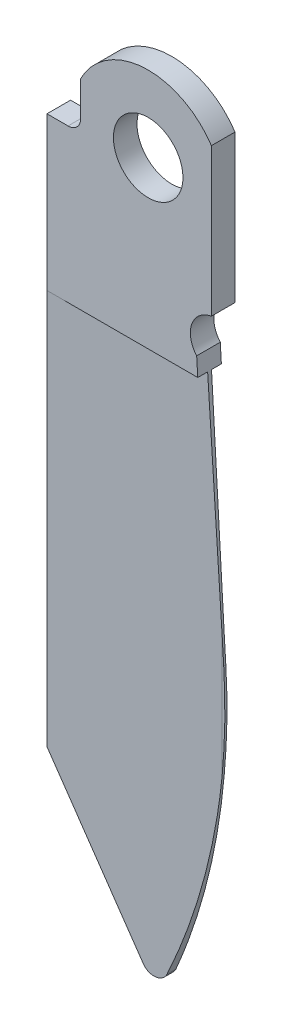
ISO-10303-21;
HEADER;
FILE_DESCRIPTION(('STEP AP214'),'2;1');
FILE_NAME('part.step','',(''),(''),'','','');
FILE_SCHEMA(('AUTOMOTIVE_DESIGN { 1 0 10303 214 1 1 1 1 }'));
ENDSEC;
DATA;
#1=APPLICATION_CONTEXT('core data for automotive mechanical design processes');
#2=APPLICATION_PROTOCOL_DEFINITION('international standard','automotive_design',2000,#1);
#3=PRODUCT_CONTEXT('',#1,'mechanical');
#4=PRODUCT('Part','Part','',(#3));
#5=PRODUCT_RELATED_PRODUCT_CATEGORY('part','',(#4));
#6=PRODUCT_DEFINITION_FORMATION('','',#4);
#7=PRODUCT_DEFINITION_CONTEXT('part definition',#1,'design');
#8=PRODUCT_DEFINITION('design','',#6,#7);
#9=PRODUCT_DEFINITION_SHAPE('','',#8);
#10=(LENGTH_UNIT() NAMED_UNIT(*) SI_UNIT(.MILLI.,.METRE.));
#11=(NAMED_UNIT(*) PLANE_ANGLE_UNIT() SI_UNIT($,.RADIAN.));
#12=(NAMED_UNIT(*) SI_UNIT($,.STERADIAN.) SOLID_ANGLE_UNIT());
#13=UNCERTAINTY_MEASURE_WITH_UNIT(LENGTH_MEASURE(1.E-05),#10,'distance_accuracy_value','');
#14=(GEOMETRIC_REPRESENTATION_CONTEXT(3) GLOBAL_UNCERTAINTY_ASSIGNED_CONTEXT((#13)) GLOBAL_UNIT_ASSIGNED_CONTEXT((#10,
#11,#12)) REPRESENTATION_CONTEXT('',''));
#15=CARTESIAN_POINT('',(0.,0.,0.));
#16=DIRECTION('',(0.,0.,1.));
#17=DIRECTION('',(1.,0.,0.));
#18=AXIS2_PLACEMENT_3D('',#15,#16,#17);
#19=CARTESIAN_POINT('',(54.8751910903859,25.8806728008312,0.7112));
#20=DIRECTION('',(0.849790592587873,0.527120430972992,0.));
#21=DIRECTION('',(-0.527120430972992,0.849790592587872,0.));
#22=AXIS2_PLACEMENT_3D('',#19,#20,#21);
#23=PLANE('',#22);
#24=DIRECTION('',(-0.526807632953416,0.849286319183169,-0.0344451144623387));
#25=VECTOR('',#24,1.);
#26=CARTESIAN_POINT('',(54.9010018885517,25.8390622462411,-0.709512370889155));
#27=LINE('',#26,#25);
#28=CARTESIAN_POINT('',(60.3236506588339,17.0970070324297,-0.354954566678399));
#29=VERTEX_POINT('',#28);
#30=CARTESIAN_POINT('',(54.8751910903858,25.8806728008312,-0.7112));
#31=VERTEX_POINT('',#30);
#32=EDGE_CURVE('E333',#29,#31,#27,.T.);
#33=ORIENTED_EDGE('',*,*,#32,.F.);
#34=DIRECTION('',(0.,0.,-1.));
#35=VECTOR('',#34,1.);
#36=CARTESIAN_POINT('',(60.3236506588339,17.0970070324297,0.7112));
#37=LINE('',#36,#35);
#38=CARTESIAN_POINT('',(60.3236506588339,17.0970070324297,0.354954566678399));
#39=VERTEX_POINT('',#38);
#40=EDGE_CURVE('E283',#39,#29,#37,.T.);
#41=ORIENTED_EDGE('',*,*,#40,.F.);
#42=DIRECTION('',(0.526807632953416,-0.849286319183169,-0.0344451144623387));
#43=VECTOR('',#42,1.);
#44=CARTESIAN_POINT('',(54.8751910903859,25.8806728008312,0.7112));
#45=LINE('',#44,#43);
#46=CARTESIAN_POINT('',(54.8751910903858,25.8806728008312,0.7112));
#47=VERTEX_POINT('',#46);
#48=EDGE_CURVE('E187',#47,#39,#45,.T.);
#49=ORIENTED_EDGE('',*,*,#48,.F.);
#50=DIRECTION('',(0.,0.,-1.));
#51=VECTOR('',#50,1.);
#52=CARTESIAN_POINT('',(54.8751910903859,25.8806728008312,0.7112));
#53=LINE('',#52,#51);
#54=EDGE_CURVE('E287',#47,#31,#53,.T.);
#55=ORIENTED_EDGE('',*,*,#54,.T.);
#56=EDGE_LOOP('',(#33,#41,#49,#55));
#57=FACE_BOUND('',#56,.T.);
#58=ADVANCED_FACE('F39',(#57),#23,.F.);
#59=CARTESIAN_POINT('',(60.9711910903859,17.4986728008312,0.7112));
#60=DIRECTION('',(0.,0.,-1.));
#61=DIRECTION('',(-1.,0.,0.));
#62=AXIS2_PLACEMENT_3D('',#59,#60,#61);
#63=CYLINDRICAL_SURFACE('',#62,0.762000000000022);
#64=CARTESIAN_POINT('',(60.9711910903859,17.4986728008312,-0.312615384615385));
#65=DIRECTION('',(0.0652452974777819,0.,-0.997869255542546));
#66=DIRECTION('',(-0.997869255542546,0.,-0.0652452974777819));
#67=AXIS2_PLACEMENT_3D('',#64,#65,#66);
#68=ELLIPSE('',#67,0.763627094198546,0.762000000000022);
#69=CARTESIAN_POINT('',(61.6662953678847,17.1864644674978,-0.267166258778919));
#70=VERTEX_POINT('',#69);
#71=EDGE_CURVE('E330',#70,#29,#68,.T.);
#72=ORIENTED_EDGE('',*,*,#71,.F.);
#73=DIRECTION('',(0.,0.,-1.));
#74=VECTOR('',#73,1.);
#75=CARTESIAN_POINT('',(61.6662953678847,17.1864644674978,0.7112));
#76=LINE('',#75,#74);
#77=CARTESIAN_POINT('',(61.6662953678847,17.1864644674978,0.267166258778919));
#78=VERTEX_POINT('',#77);
#79=EDGE_CURVE('E280',#78,#70,#76,.T.);
#80=ORIENTED_EDGE('',*,*,#79,.F.);
#81=CARTESIAN_POINT('',(60.9711910903859,17.4986728008312,0.312615384615385));
#82=DIRECTION('',(0.0652452974777819,0.,0.997869255542546));
#83=DIRECTION('',(0.997869255542546,0.,-0.0652452974777819));
#84=AXIS2_PLACEMENT_3D('',#81,#82,#83);
#85=ELLIPSE('',#84,0.763627094198546,0.762000000000022);
#86=EDGE_CURVE('E181',#39,#78,#85,.T.);
#87=ORIENTED_EDGE('',*,*,#86,.F.);
#88=ORIENTED_EDGE('',*,*,#40,.T.);
#89=EDGE_LOOP('',(#72,#80,#87,#88));
#90=FACE_BOUND('',#89,.T.);
#91=ADVANCED_FACE('F345',(#90),#63,.T.);
#92=CARTESIAN_POINT('',(27.6061857704402,32.4846728008312,0.7112));
#93=DIRECTION('',(0.,0.,-1.));
#94=DIRECTION('',(-1.,0.,0.));
#95=AXIS2_PLACEMENT_3D('',#92,#93,#94);
#96=CYLINDRICAL_SURFACE('',#95,37.338);
#97=DIRECTION('',(0.,0.,-1.));
#98=VECTOR('',#97,1.);
#99=CARTESIAN_POINT('',(64.8741404768633,34.7706728008312,0.7112));
#100=LINE('',#99,#98);
#101=CARTESIAN_POINT('',(64.8741404768633,34.7706728008312,0.0635));
#102=VERTEX_POINT('',#101);
#103=CARTESIAN_POINT('',(64.8741404768633,34.7706728008312,-0.0634999999999979));
#104=VERTEX_POINT('',#103);
#105=EDGE_CURVE('E175',#102,#104,#100,.T.);
#106=ORIENTED_EDGE('',*,*,#105,.F.);
#107=CARTESIAN_POINT('',(27.6061857704402,32.4846728008312,0.0635));
#108=DIRECTION('',(0.,0.,-1.));
#109=DIRECTION('',(-1.,0.,0.));
#110=AXIS2_PLACEMENT_3D('',#107,#108,#109);
#111=CIRCLE('',#110,37.338);
#112=CARTESIAN_POINT('',(64.7811910903859,28.9996730214892,0.0635));
#113=VERTEX_POINT('',#112);
#114=EDGE_CURVE('E157',#102,#113,#111,.T.);
#115=ORIENTED_EDGE('',*,*,#114,.T.);
#116=CARTESIAN_POINT('',(27.6061857704402,32.4846728008312,2.49417342476567));
#117=DIRECTION('',(0.0652452974777819,0.,0.997869255542546));
#118=DIRECTION('',(0.997869255542546,0.,-0.0652452974777819));
#119=AXIS2_PLACEMENT_3D('',#116,#117,#118);
#120=ELLIPSE('',#119,37.4177276157277,37.338);
#121=EDGE_CURVE('E171',#78,#113,#120,.T.);
#122=ORIENTED_EDGE('',*,*,#121,.F.);
#123=ORIENTED_EDGE('',*,*,#79,.T.);
#124=CARTESIAN_POINT('',(27.6061857704402,32.4846728008312,-2.49417342476567));
#125=DIRECTION('',(0.0652452974777819,0.,-0.997869255542546));
#126=DIRECTION('',(-0.997869255542546,0.,-0.0652452974777819));
#127=AXIS2_PLACEMENT_3D('',#124,#125,#126);
#128=ELLIPSE('',#127,37.4177276157277,37.338);
#129=CARTESIAN_POINT('',(64.7811910903859,28.9996730214892,-0.0635));
#130=VERTEX_POINT('',#129);
#131=EDGE_CURVE('E322',#130,#70,#128,.T.);
#132=ORIENTED_EDGE('',*,*,#131,.F.);
#133=CARTESIAN_POINT('',(27.6061857704402,32.4846728008312,-0.0634999999999979));
#134=DIRECTION('',(0.,0.,1.));
#135=DIRECTION('',(1.,0.,0.));
#136=AXIS2_PLACEMENT_3D('',#133,#134,#135);
#137=CIRCLE('',#136,37.338);
#138=EDGE_CURVE('E347',#130,#104,#137,.T.);
#139=ORIENTED_EDGE('',*,*,#138,.T.);
#140=EDGE_LOOP('',(#106,#115,#122,#123,#132,#139));
#141=FACE_BOUND('',#140,.T.);
#142=ADVANCED_FACE('F169',(#141),#96,.T.);
#143=CARTESIAN_POINT('',(64.8741404768633,34.7706728008312,0.7112));
#144=DIRECTION('',(-0.998124021276529,-0.061224489795918,0.));
#145=DIRECTION('',(0.061224489795918,-0.998124021276529,0.));
#146=AXIS2_PLACEMENT_3D('',#143,#144,#145);
#147=PLANE('',#146);
#148=DIRECTION('',(-0.0612239992366834,0.99811602384025,0.00400310764239853));
#149=VECTOR('',#148,1.);
#150=CARTESIAN_POINT('',(64.8739802449912,34.773285011745,0.0574330168142626));
#151=LINE('',#150,#149);
#152=CARTESIAN_POINT('',(64.7811910903859,36.2859980524623,0.0634999999999988));
#153=VERTEX_POINT('',#152);
#154=CARTESIAN_POINT('',(63.9594616691361,49.6824,0.117228462158635));
#155=VERTEX_POINT('',#154);
#156=EDGE_CURVE('E183',#153,#155,#151,.T.);
#157=ORIENTED_EDGE('',*,*,#156,.F.);
#158=DIRECTION('',(0.061224489795918,-0.998124021276529,0.));
#159=VECTOR('',#158,1.);
#160=CARTESIAN_POINT('',(64.8741404768633,34.7706728008312,0.0635));
#161=LINE('',#160,#159);
#162=EDGE_CURVE('E159',#153,#102,#161,.T.);
#163=ORIENTED_EDGE('',*,*,#162,.T.);
#164=ORIENTED_EDGE('',*,*,#105,.T.);
#165=DIRECTION('',(-0.061224489795918,0.998124021276529,0.));
#166=VECTOR('',#165,1.);
#167=CARTESIAN_POINT('',(64.8741404768633,34.7706728008312,-0.0634999999999979));
#168=LINE('',#167,#166);
#169=CARTESIAN_POINT('',(64.7811910903859,36.2859980524619,-0.0634999999999979));
#170=VERTEX_POINT('',#169);
#171=EDGE_CURVE('E177',#104,#170,#168,.T.);
#172=ORIENTED_EDGE('',*,*,#171,.T.);
#173=DIRECTION('',(0.0612239992366834,-0.99811602384025,0.00400310764239853));
#174=VECTOR('',#173,1.);
#175=CARTESIAN_POINT('',(64.8743288556864,34.767601718833,-0.0574102230380415));
#176=LINE('',#175,#174);
#177=CARTESIAN_POINT('',(63.9594616691361,49.6824,-0.117228462158635));
#178=VERTEX_POINT('',#177);
#179=EDGE_CURVE('E316',#178,#170,#176,.T.);
#180=ORIENTED_EDGE('',*,*,#179,.F.);
#181=DIRECTION('',(0.,0.,-1.));
#182=VECTOR('',#181,1.);
#183=CARTESIAN_POINT('',(63.9594616691361,49.6824,0.7112));
#184=LINE('',#183,#182);
#185=CARTESIAN_POINT('',(63.9594616691361,49.6824,-0.7112));
#186=VERTEX_POINT('',#185);
#187=EDGE_CURVE('E309',#178,#186,#184,.T.);
#188=ORIENTED_EDGE('',*,*,#187,.T.);
#189=DIRECTION('',(-0.061224489795918,0.998124021276529,0.));
#190=VECTOR('',#189,1.);
#191=CARTESIAN_POINT('',(64.8741404768633,34.7706728008312,-0.7112));
#192=LINE('',#191,#190);
#193=CARTESIAN_POINT('',(63.892088906043,50.780757429309,-0.7112));
#194=VERTEX_POINT('',#193);
#195=EDGE_CURVE('E238',#186,#194,#192,.T.);
#196=ORIENTED_EDGE('',*,*,#195,.T.);
#197=DIRECTION('',(0.,0.,-1.));
#198=VECTOR('',#197,1.);
#199=CARTESIAN_POINT('',(63.892088906043,50.780757429309,0.7112));
#200=LINE('',#199,#198);
#201=CARTESIAN_POINT('',(63.892088906043,50.780757429309,0.7112));
#202=VERTEX_POINT('',#201);
#203=EDGE_CURVE('E274',#202,#194,#200,.T.);
#204=ORIENTED_EDGE('',*,*,#203,.F.);
#205=DIRECTION('',(-0.061224489795918,0.998124021276529,0.));
#206=VECTOR('',#205,1.);
#207=CARTESIAN_POINT('',(64.8741404768633,34.7706728008312,0.7112));
#208=LINE('',#207,#206);
#209=CARTESIAN_POINT('',(63.9594616691361,49.6824,0.7112));
#210=VERTEX_POINT('',#209);
#211=EDGE_CURVE('E212',#210,#202,#208,.T.);
#212=ORIENTED_EDGE('',*,*,#211,.F.);
#213=DIRECTION('',(0.,0.,1.));
#214=VECTOR('',#213,1.);
#215=CARTESIAN_POINT('',(63.9594616691361,49.6824,0.7112));
#216=LINE('',#215,#214);
#217=EDGE_CURVE('E55',#155,#210,#216,.T.);
#218=ORIENTED_EDGE('',*,*,#217,.F.);
#219=EDGE_LOOP('',(#157,#163,#164,#172,#180,#188,#196,#204,#212,#218));
#220=FACE_BOUND('',#219,.T.);
#221=ADVANCED_FACE('F312',(#220),#147,.F.);
#222=CARTESIAN_POINT('',(56.1451910903858,59.6626728008312,0.7112));
#223=DIRECTION('',(0.,0.,1.));
#224=DIRECTION('',(1.,0.,0.));
#225=AXIS2_PLACEMENT_3D('',#222,#223,#224);
#226=PLANE('',#225);
#227=CARTESIAN_POINT('',(60.9711910903858,59.6626728008312,0.7112));
#228=DIRECTION('',(0.,0.,1.));
#229=DIRECTION('',(1.,0.,0.));
#230=AXIS2_PLACEMENT_3D('',#227,#228,#229);
#231=CIRCLE('',#230,2.0955);
#232=CARTESIAN_POINT('',(63.0666910903858,59.6626728008312,0.7112));
#233=VERTEX_POINT('',#232);
#234=EDGE_CURVE('E194',#233,#233,#231,.T.);
#235=ORIENTED_EDGE('',*,*,#234,.F.);
#236=EDGE_LOOP('',(#235));
#237=FACE_BOUND('',#236,.T.);
#238=DIRECTION('',(0.,-1.,0.));
#239=VECTOR('',#238,1.);
#240=CARTESIAN_POINT('',(54.8751910903858,58.9006728008311,0.7112));
#241=LINE('',#240,#239);
#242=CARTESIAN_POINT('',(54.8751910903858,58.9006728008311,0.7112));
#243=VERTEX_POINT('',#242);
#244=CARTESIAN_POINT('',(54.8751910903858,49.6824,0.7112));
#245=VERTEX_POINT('',#244);
#246=EDGE_CURVE('E207',#243,#245,#241,.T.);
#247=ORIENTED_EDGE('',*,*,#246,.T.);
#248=DIRECTION('',(1.,0.,0.));
#249=VECTOR('',#248,1.);
#250=CARTESIAN_POINT('',(54.8751910903858,49.6824,0.7112));
#251=LINE('',#250,#249);
#252=EDGE_CURVE('E356',#245,#210,#251,.T.);
#253=ORIENTED_EDGE('',*,*,#252,.T.);
#254=ORIENTED_EDGE('',*,*,#211,.T.);
#255=CARTESIAN_POINT('',(65.0351910903858,51.7886728008312,0.7112));
#256=DIRECTION('',(0.,0.,-1.));
#257=DIRECTION('',(1.,0.,0.));
#258=AXIS2_PLACEMENT_3D('',#255,#256,#257);
#259=CIRCLE('',#258,1.52399999999998);
#260=CARTESIAN_POINT('',(64.7811910903858,53.2913570657385,0.7112));
#261=VERTEX_POINT('',#260);
#262=EDGE_CURVE('E215',#202,#261,#259,.T.);
#263=ORIENTED_EDGE('',*,*,#262,.T.);
#264=DIRECTION('',(0.,1.,0.));
#265=VECTOR('',#264,1.);
#266=CARTESIAN_POINT('',(64.7811910903858,53.2913570657385,0.7112));
#267=LINE('',#266,#265);
#268=CARTESIAN_POINT('',(64.7811910903858,62.189940891082,0.7112));
#269=VERTEX_POINT('',#268);
#270=EDGE_CURVE('E218',#261,#269,#267,.T.);
#271=ORIENTED_EDGE('',*,*,#270,.T.);
#272=CARTESIAN_POINT('',(60.9711910903858,59.6626728008312,0.7112));
#273=DIRECTION('',(0.,0.,1.));
#274=DIRECTION('',(1.,0.,0.));
#275=AXIS2_PLACEMENT_3D('',#272,#273,#274);
#276=CIRCLE('',#275,4.572);
#277=CARTESIAN_POINT('',(56.9071910903859,61.7572104586449,0.7112));
#278=VERTEX_POINT('',#277);
#279=EDGE_CURVE('E221',#269,#278,#276,.T.);
#280=ORIENTED_EDGE('',*,*,#279,.T.);
#281=DIRECTION('',(0.,-1.,0.));
#282=VECTOR('',#281,1.);
#283=CARTESIAN_POINT('',(56.9071910903859,61.7572104586449,0.7112));
#284=LINE('',#283,#282);
#285=CARTESIAN_POINT('',(56.9071910903859,59.6626728008312,0.7112));
#286=VERTEX_POINT('',#285);
#287=EDGE_CURVE('E224',#278,#286,#284,.T.);
#288=ORIENTED_EDGE('',*,*,#287,.T.);
#289=CARTESIAN_POINT('',(56.1451910903858,59.6626728008312,0.7112));
#290=DIRECTION('',(0.,0.,-1.));
#291=DIRECTION('',(1.,0.,0.));
#292=AXIS2_PLACEMENT_3D('',#289,#290,#291);
#293=CIRCLE('',#292,0.762000000000047);
#294=CARTESIAN_POINT('',(56.1451910903858,58.9006728008311,0.7112));
#295=VERTEX_POINT('',#294);
#296=EDGE_CURVE('E227',#286,#295,#293,.T.);
#297=ORIENTED_EDGE('',*,*,#296,.T.);
#298=DIRECTION('',(-1.,0.,0.));
#299=VECTOR('',#298,1.);
#300=CARTESIAN_POINT('',(54.8751910903858,58.9006728008311,0.7112));
#301=LINE('',#300,#299);
#302=EDGE_CURVE('E203',#295,#243,#301,.T.);
#303=ORIENTED_EDGE('',*,*,#302,.T.);
#304=EDGE_LOOP('',(#247,#253,#254,#263,#271,#280,#288,#297,#303));
#305=FACE_BOUND('',#304,.T.);
#306=ADVANCED_FACE('F370',(#237,#305),#226,.T.);
#307=CARTESIAN_POINT('',(54.8751910903858,58.9006728008311,0.7112));
#308=DIRECTION('',(0.,-1.,0.));
#309=DIRECTION('',(0.,0.,-1.));
#310=AXIS2_PLACEMENT_3D('',#307,#308,#309);
#311=PLANE('',#310);
#312=DIRECTION('',(-1.,0.,0.));
#313=VECTOR('',#312,1.);
#314=CARTESIAN_POINT('',(54.8751910903858,58.9006728008311,-0.7112));
#315=LINE('',#314,#313);
#316=CARTESIAN_POINT('',(56.1451910903858,58.9006728008311,-0.7112));
#317=VERTEX_POINT('',#316);
#318=CARTESIAN_POINT('',(54.8751910903858,58.9006728008311,-0.7112));
#319=VERTEX_POINT('',#318);
#320=EDGE_CURVE('E199',#317,#319,#315,.T.);
#321=ORIENTED_EDGE('',*,*,#320,.T.);
#322=DIRECTION('',(0.,0.,-1.));
#323=VECTOR('',#322,1.);
#324=CARTESIAN_POINT('',(54.8751910903858,58.9006728008311,0.7112));
#325=LINE('',#324,#323);
#326=EDGE_CURVE('E48',#243,#319,#325,.T.);
#327=ORIENTED_EDGE('',*,*,#326,.F.);
#328=ORIENTED_EDGE('',*,*,#302,.F.);
#329=DIRECTION('',(0.,0.,-1.));
#330=VECTOR('',#329,1.);
#331=CARTESIAN_POINT('',(56.1451910903858,58.9006728008311,0.7112));
#332=LINE('',#331,#330);
#333=EDGE_CURVE('E230',#295,#317,#332,.T.);
#334=ORIENTED_EDGE('',*,*,#333,.T.);
#335=EDGE_LOOP('',(#321,#327,#328,#334));
#336=FACE_BOUND('',#335,.T.);
#337=ADVANCED_FACE('F41',(#336),#311,.F.);
#338=CARTESIAN_POINT('',(54.8751910903858,58.9006728008311,0.7112));
#339=DIRECTION('',(1.,0.,0.));
#340=DIRECTION('',(0.,1.,0.));
#341=AXIS2_PLACEMENT_3D('',#338,#339,#340);
#342=PLANE('',#341);
#343=DIRECTION('',(0.,-1.,0.));
#344=VECTOR('',#343,1.);
#345=CARTESIAN_POINT('',(54.8751910903858,58.9006728008311,-0.7112));
#346=LINE('',#345,#344);
#347=CARTESIAN_POINT('',(54.8751910903858,49.6824,-0.7112));
#348=VERTEX_POINT('',#347);
#349=EDGE_CURVE('E234',#319,#348,#346,.T.);
#350=ORIENTED_EDGE('',*,*,#349,.T.);
#351=DIRECTION('',(0.,-1.,0.));
#352=VECTOR('',#351,1.);
#353=CARTESIAN_POINT('',(54.8751910903858,49.6824,-0.7112));
#354=LINE('',#353,#352);
#355=EDGE_CURVE('E318',#348,#31,#354,.T.);
#356=ORIENTED_EDGE('',*,*,#355,.T.);
#357=ORIENTED_EDGE('',*,*,#54,.F.);
#358=DIRECTION('',(0.,-1.,0.));
#359=VECTOR('',#358,1.);
#360=CARTESIAN_POINT('',(54.8751910903858,49.6824,0.7112));
#361=LINE('',#360,#359);
#362=EDGE_CURVE('E164',#245,#47,#361,.T.);
#363=ORIENTED_EDGE('',*,*,#362,.F.);
#364=ORIENTED_EDGE('',*,*,#246,.F.);
#365=ORIENTED_EDGE('',*,*,#326,.T.);
#366=EDGE_LOOP('',(#350,#356,#357,#363,#364,#365));
#367=FACE_BOUND('',#366,.T.);
#368=ADVANCED_FACE('F294',(#367),#342,.F.);
#369=CARTESIAN_POINT('',(65.0351910903858,51.7886728008312,0.7112));
#370=DIRECTION('',(0.,0.,-1.));
#371=DIRECTION('',(-1.,0.,0.));
#372=AXIS2_PLACEMENT_3D('',#369,#370,#371);
#373=CYLINDRICAL_SURFACE('',#372,1.52399999999998);
#374=CARTESIAN_POINT('',(65.0351910903858,51.7886728008312,-0.7112));
#375=DIRECTION('',(0.,0.,-1.));
#376=DIRECTION('',(1.,0.,0.));
#377=AXIS2_PLACEMENT_3D('',#374,#375,#376);
#378=CIRCLE('',#377,1.52399999999998);
#379=CARTESIAN_POINT('',(64.7811910903858,53.2913570657385,-0.7112));
#380=VERTEX_POINT('',#379);
#381=EDGE_CURVE('E241',#194,#380,#378,.T.);
#382=ORIENTED_EDGE('',*,*,#381,.T.);
#383=DIRECTION('',(0.,0.,-1.));
#384=VECTOR('',#383,1.);
#385=CARTESIAN_POINT('',(64.7811910903858,53.2913570657385,0.7112));
#386=LINE('',#385,#384);
#387=EDGE_CURVE('E270',#261,#380,#386,.T.);
#388=ORIENTED_EDGE('',*,*,#387,.F.);
#389=ORIENTED_EDGE('',*,*,#262,.F.);
#390=ORIENTED_EDGE('',*,*,#203,.T.);
#391=EDGE_LOOP('',(#382,#388,#389,#390));
#392=FACE_BOUND('',#391,.T.);
#393=ADVANCED_FACE('F391',(#392),#373,.F.);
#394=CARTESIAN_POINT('',(64.7811910903858,53.2913570657385,0.7112));
#395=DIRECTION('',(-1.,0.,0.));
#396=DIRECTION('',(0.,-1.,0.));
#397=AXIS2_PLACEMENT_3D('',#394,#395,#396);
#398=PLANE('',#397);
#399=DIRECTION('',(0.,1.,0.));
#400=VECTOR('',#399,1.);
#401=CARTESIAN_POINT('',(64.7811910903858,53.2913570657385,-0.7112));
#402=LINE('',#401,#400);
#403=CARTESIAN_POINT('',(64.7811910903858,62.189940891082,-0.7112));
#404=VERTEX_POINT('',#403);
#405=EDGE_CURVE('E244',#380,#404,#402,.T.);
#406=ORIENTED_EDGE('',*,*,#405,.T.);
#407=DIRECTION('',(0.,0.,-1.));
#408=VECTOR('',#407,1.);
#409=CARTESIAN_POINT('',(64.7811910903858,62.189940891082,0.7112));
#410=LINE('',#409,#408);
#411=EDGE_CURVE('E266',#269,#404,#410,.T.);
#412=ORIENTED_EDGE('',*,*,#411,.F.);
#413=ORIENTED_EDGE('',*,*,#270,.F.);
#414=ORIENTED_EDGE('',*,*,#387,.T.);
#415=EDGE_LOOP('',(#406,#412,#413,#414));
#416=FACE_BOUND('',#415,.T.);
#417=ADVANCED_FACE('F387',(#416),#398,.F.);
#418=CARTESIAN_POINT('',(60.9711910903858,59.6626728008312,0.7112));
#419=DIRECTION('',(0.,0.,-1.));
#420=DIRECTION('',(-1.,0.,0.));
#421=AXIS2_PLACEMENT_3D('',#418,#419,#420);
#422=CYLINDRICAL_SURFACE('',#421,4.572);
#423=CARTESIAN_POINT('',(60.9711910903858,59.6626728008312,-0.7112));
#424=DIRECTION('',(0.,0.,1.));
#425=DIRECTION('',(1.,0.,0.));
#426=AXIS2_PLACEMENT_3D('',#423,#424,#425);
#427=CIRCLE('',#426,4.572);
#428=CARTESIAN_POINT('',(56.9071910903859,61.7572104586449,-0.7112));
#429=VERTEX_POINT('',#428);
#430=EDGE_CURVE('E247',#404,#429,#427,.T.);
#431=ORIENTED_EDGE('',*,*,#430,.T.);
#432=DIRECTION('',(0.,0.,-1.));
#433=VECTOR('',#432,1.);
#434=CARTESIAN_POINT('',(56.9071910903859,61.7572104586449,0.7112));
#435=LINE('',#434,#433);
#436=EDGE_CURVE('E262',#278,#429,#435,.T.);
#437=ORIENTED_EDGE('',*,*,#436,.F.);
#438=ORIENTED_EDGE('',*,*,#279,.F.);
#439=ORIENTED_EDGE('',*,*,#411,.T.);
#440=EDGE_LOOP('',(#431,#437,#438,#439));
#441=FACE_BOUND('',#440,.T.);
#442=ADVANCED_FACE('F382',(#441),#422,.T.);
#443=CARTESIAN_POINT('',(56.9071910903859,61.7572104586449,0.7112));
#444=DIRECTION('',(1.,0.,0.));
#445=DIRECTION('',(0.,0.,-1.));
#446=AXIS2_PLACEMENT_3D('',#443,#444,#445);
#447=PLANE('',#446);
#448=DIRECTION('',(0.,-1.,0.));
#449=VECTOR('',#448,1.);
#450=CARTESIAN_POINT('',(56.9071910903859,61.7572104586449,-0.7112));
#451=LINE('',#450,#449);
#452=CARTESIAN_POINT('',(56.9071910903859,59.6626728008312,-0.7112));
#453=VERTEX_POINT('',#452);
#454=EDGE_CURVE('E250',#429,#453,#451,.T.);
#455=ORIENTED_EDGE('',*,*,#454,.T.);
#456=DIRECTION('',(0.,0.,-1.));
#457=VECTOR('',#456,1.);
#458=CARTESIAN_POINT('',(56.9071910903859,59.6626728008312,0.7112));
#459=LINE('',#458,#457);
#460=EDGE_CURVE('E258',#286,#453,#459,.T.);
#461=ORIENTED_EDGE('',*,*,#460,.F.);
#462=ORIENTED_EDGE('',*,*,#287,.F.);
#463=ORIENTED_EDGE('',*,*,#436,.T.);
#464=EDGE_LOOP('',(#455,#461,#462,#463));
#465=FACE_BOUND('',#464,.T.);
#466=ADVANCED_FACE('F377',(#465),#447,.F.);
#467=CARTESIAN_POINT('',(56.1451910903858,59.6626728008312,0.7112));
#468=DIRECTION('',(0.,0.,-1.));
#469=DIRECTION('',(-1.,0.,0.));
#470=AXIS2_PLACEMENT_3D('',#467,#468,#469);
#471=CYLINDRICAL_SURFACE('',#470,0.762000000000047);
#472=CARTESIAN_POINT('',(56.1451910903858,59.6626728008312,-0.7112));
#473=DIRECTION('',(0.,0.,-1.));
#474=DIRECTION('',(1.,0.,0.));
#475=AXIS2_PLACEMENT_3D('',#472,#473,#474);
#476=CIRCLE('',#475,0.762000000000047);
#477=EDGE_CURVE('E208',#453,#317,#476,.T.);
#478=ORIENTED_EDGE('',*,*,#477,.T.);
#479=ORIENTED_EDGE('',*,*,#333,.F.);
#480=ORIENTED_EDGE('',*,*,#296,.F.);
#481=ORIENTED_EDGE('',*,*,#460,.T.);
#482=EDGE_LOOP('',(#478,#479,#480,#481));
#483=FACE_BOUND('',#482,.T.);
#484=ADVANCED_FACE('F375',(#483),#471,.F.);
#485=CARTESIAN_POINT('',(56.1451910903858,59.6626728008312,-0.7112));
#486=DIRECTION('',(0.,0.,1.));
#487=DIRECTION('',(1.,0.,0.));
#488=AXIS2_PLACEMENT_3D('',#485,#486,#487);
#489=PLANE('',#488);
#490=CARTESIAN_POINT('',(60.9711910903858,59.6626728008312,-0.7112));
#491=DIRECTION('',(0.,0.,1.));
#492=DIRECTION('',(1.,0.,0.));
#493=AXIS2_PLACEMENT_3D('',#490,#491,#492);
#494=CIRCLE('',#493,2.0955);
#495=CARTESIAN_POINT('',(63.0666910903858,59.6626728008312,-0.7112));
#496=VERTEX_POINT('',#495);
#497=EDGE_CURVE('E195',#496,#496,#494,.T.);
#498=ORIENTED_EDGE('',*,*,#497,.T.);
#499=EDGE_LOOP('',(#498));
#500=FACE_BOUND('',#499,.T.);
#501=ORIENTED_EDGE('',*,*,#195,.F.);
#502=DIRECTION('',(-1.,0.,0.));
#503=VECTOR('',#502,1.);
#504=CARTESIAN_POINT('',(56.1451910903858,49.6824,-0.7112));
#505=LINE('',#504,#503);
#506=EDGE_CURVE('E11',#186,#348,#505,.T.);
#507=ORIENTED_EDGE('',*,*,#506,.T.);
#508=ORIENTED_EDGE('',*,*,#349,.F.);
#509=ORIENTED_EDGE('',*,*,#320,.F.);
#510=ORIENTED_EDGE('',*,*,#477,.F.);
#511=ORIENTED_EDGE('',*,*,#454,.F.);
#512=ORIENTED_EDGE('',*,*,#430,.F.);
#513=ORIENTED_EDGE('',*,*,#405,.F.);
#514=ORIENTED_EDGE('',*,*,#381,.F.);
#515=EDGE_LOOP('',(#501,#507,#508,#509,#510,#511,#512,#513,#514));
#516=FACE_BOUND('',#515,.T.);
#517=ADVANCED_FACE('F304',(#500,#516),#489,.F.);
#518=CARTESIAN_POINT('',(60.9711910903858,59.6626728008312,-0.7112));
#519=DIRECTION('',(0.,0.,1.));
#520=DIRECTION('',(1.,0.,0.));
#521=AXIS2_PLACEMENT_3D('',#518,#519,#520);
#522=CYLINDRICAL_SURFACE('',#521,2.0955);
#523=ORIENTED_EDGE('',*,*,#497,.F.);
#524=EDGE_LOOP('',(#523));
#525=FACE_BOUND('',#524,.T.);
#526=ORIENTED_EDGE('',*,*,#234,.T.);
#527=EDGE_LOOP('',(#526));
#528=FACE_BOUND('',#527,.T.);
#529=ADVANCED_FACE('F420',(#525,#528),#522,.F.);
#530=CARTESIAN_POINT('',(64.7811910903859,49.6824,-0.0635));
#531=DIRECTION('',(0.0652452974777819,0.,-0.997869255542546));
#532=DIRECTION('',(-0.997869255542546,0.,-0.0652452974777819));
#533=AXIS2_PLACEMENT_3D('',#530,#531,#532);
#534=PLANE('',#533);
#535=ORIENTED_EDGE('',*,*,#32,.T.);
#536=ORIENTED_EDGE('',*,*,#355,.F.);
#537=DIRECTION('',(0.997869255542547,0.,0.0652452974777819));
#538=VECTOR('',#537,1.);
#539=CARTESIAN_POINT('',(64.7811910903859,49.6824,-0.0635));
#540=LINE('',#539,#538);
#541=EDGE_CURVE('E63',#348,#178,#540,.T.);
#542=ORIENTED_EDGE('',*,*,#541,.T.);
#543=ORIENTED_EDGE('',*,*,#179,.T.);
#544=DIRECTION('',(0.,-1.,0.));
#545=VECTOR('',#544,1.);
#546=CARTESIAN_POINT('',(64.7811910903859,49.6824,-0.0635));
#547=LINE('',#546,#545);
#548=EDGE_CURVE('E324',#170,#130,#547,.T.);
#549=ORIENTED_EDGE('',*,*,#548,.T.);
#550=ORIENTED_EDGE('',*,*,#131,.T.);
#551=ORIENTED_EDGE('',*,*,#71,.T.);
#552=EDGE_LOOP('',(#535,#536,#542,#543,#549,#550,#551));
#553=FACE_BOUND('',#552,.T.);
#554=ADVANCED_FACE('F338',(#553),#534,.T.);
#555=CARTESIAN_POINT('',(0.,49.6824,0.));
#556=DIRECTION('',(0.,1.,0.));
#557=DIRECTION('',(0.,0.,1.));
#558=AXIS2_PLACEMENT_3D('',#555,#556,#557);
#559=PLANE('',#558);
#560=ORIENTED_EDGE('',*,*,#541,.F.);
#561=ORIENTED_EDGE('',*,*,#506,.F.);
#562=ORIENTED_EDGE('',*,*,#187,.F.);
#563=EDGE_LOOP('',(#560,#561,#562));
#564=FACE_BOUND('',#563,.T.);
#565=ADVANCED_FACE('F308',(#564),#559,.F.);
#566=CARTESIAN_POINT('',(54.8751910903858,49.6824,0.7112));
#567=DIRECTION('',(0.0652452974777819,0.,0.997869255542546));
#568=DIRECTION('',(0.997869255542546,0.,-0.0652452974777819));
#569=AXIS2_PLACEMENT_3D('',#566,#567,#568);
#570=PLANE('',#569);
#571=ORIENTED_EDGE('',*,*,#48,.T.);
#572=ORIENTED_EDGE('',*,*,#86,.T.);
#573=ORIENTED_EDGE('',*,*,#121,.T.);
#574=DIRECTION('',(0.,-1.,0.));
#575=VECTOR('',#574,1.);
#576=CARTESIAN_POINT('',(64.7811910903859,49.6824,0.0635));
#577=LINE('',#576,#575);
#578=EDGE_CURVE('E154',#153,#113,#577,.T.);
#579=ORIENTED_EDGE('',*,*,#578,.F.);
#580=ORIENTED_EDGE('',*,*,#156,.T.);
#581=DIRECTION('',(-0.997869255542547,0.,0.0652452974777819));
#582=VECTOR('',#581,1.);
#583=CARTESIAN_POINT('',(54.8751910903858,49.6824,0.7112));
#584=LINE('',#583,#582);
#585=EDGE_CURVE('E359',#155,#245,#584,.T.);
#586=ORIENTED_EDGE('',*,*,#585,.T.);
#587=ORIENTED_EDGE('',*,*,#362,.T.);
#588=EDGE_LOOP('',(#571,#572,#573,#579,#580,#586,#587));
#589=FACE_BOUND('',#588,.T.);
#590=ADVANCED_FACE('F179',(#589),#570,.T.);
#591=CARTESIAN_POINT('',(0.,49.6824,0.));
#592=DIRECTION('',(0.,-1.,0.));
#593=DIRECTION('',(0.,0.,-1.));
#594=AXIS2_PLACEMENT_3D('',#591,#592,#593);
#595=PLANE('',#594);
#596=ORIENTED_EDGE('',*,*,#217,.T.);
#597=ORIENTED_EDGE('',*,*,#252,.F.);
#598=ORIENTED_EDGE('',*,*,#585,.F.);
#599=EDGE_LOOP('',(#596,#597,#598));
#600=FACE_BOUND('',#599,.T.);
#601=ADVANCED_FACE('F368',(#600),#595,.T.);
#602=CARTESIAN_POINT('',(90.1811910903859,36.2859980524631,0.0635));
#603=DIRECTION('',(0.,0.,-1.));
#604=DIRECTION('',(-1.,0.,0.));
#605=AXIS2_PLACEMENT_3D('',#602,#603,#604);
#606=PLANE('',#605);
#607=ORIENTED_EDGE('',*,*,#162,.F.);
#608=ORIENTED_EDGE('',*,*,#578,.T.);
#609=ORIENTED_EDGE('',*,*,#114,.F.);
#610=EDGE_LOOP('',(#607,#608,#609));
#611=FACE_BOUND('',#610,.T.);
#612=ADVANCED_FACE('F156',(#611),#606,.F.);
#613=CARTESIAN_POINT('',(90.1811910903859,36.2859980524619,-0.0634999999999979));
#614=DIRECTION('',(0.,0.,1.));
#615=DIRECTION('',(1.,0.,0.));
#616=AXIS2_PLACEMENT_3D('',#613,#614,#615);
#617=PLANE('',#616);
#618=ORIENTED_EDGE('',*,*,#548,.F.);
#619=ORIENTED_EDGE('',*,*,#171,.F.);
#620=ORIENTED_EDGE('',*,*,#138,.F.);
#621=EDGE_LOOP('',(#618,#619,#620));
#622=FACE_BOUND('',#621,.T.);
#623=ADVANCED_FACE('F483',(#622),#617,.F.);
#624=CLOSED_SHELL('',(#58,#91,#142,#221,#306,#337,#368,#393,#417,#442,#466,#484,#517,#529,#554,
#565,#590,#601,#612,#623));
#625=MANIFOLD_SOLID_BREP('B2',#624);
#626=ADVANCED_BREP_SHAPE_REPRESENTATION('',(#18,#625),#14);
#627=SHAPE_DEFINITION_REPRESENTATION(#9,#626);
ENDSEC;
END-ISO-10303-21;
